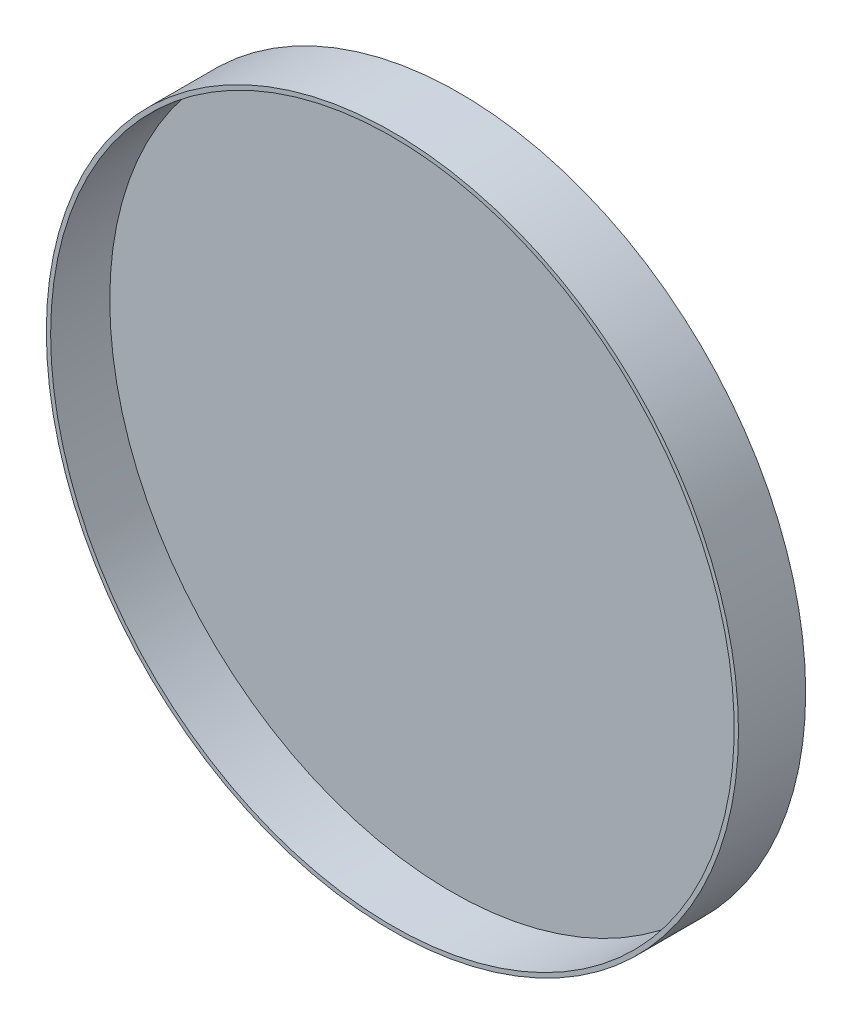
ISO-10303-21;
HEADER;
FILE_DESCRIPTION(('STEP AP214'),'2;1');
FILE_NAME('part.step','',(''),(''),'','','');
FILE_SCHEMA(('AUTOMOTIVE_DESIGN { 1 0 10303 214 1 1 1 1 }'));
ENDSEC;
DATA;
#1=APPLICATION_CONTEXT('core data for automotive mechanical design processes');
#2=APPLICATION_PROTOCOL_DEFINITION('international standard','automotive_design',2000,#1);
#3=PRODUCT_CONTEXT('',#1,'mechanical');
#4=PRODUCT('Part','Part','',(#3));
#5=PRODUCT_RELATED_PRODUCT_CATEGORY('part','',(#4));
#6=PRODUCT_DEFINITION_FORMATION('','',#4);
#7=PRODUCT_DEFINITION_CONTEXT('part definition',#1,'design');
#8=PRODUCT_DEFINITION('design','',#6,#7);
#9=PRODUCT_DEFINITION_SHAPE('','',#8);
#10=(LENGTH_UNIT() NAMED_UNIT(*) SI_UNIT(.MILLI.,.METRE.));
#11=(NAMED_UNIT(*) PLANE_ANGLE_UNIT() SI_UNIT($,.RADIAN.));
#12=(NAMED_UNIT(*) SI_UNIT($,.STERADIAN.) SOLID_ANGLE_UNIT());
#13=UNCERTAINTY_MEASURE_WITH_UNIT(LENGTH_MEASURE(1.E-05),#10,'distance_accuracy_value','');
#14=(GEOMETRIC_REPRESENTATION_CONTEXT(3) GLOBAL_UNCERTAINTY_ASSIGNED_CONTEXT((#13)) GLOBAL_UNIT_ASSIGNED_CONTEXT((#10,
#11,#12)) REPRESENTATION_CONTEXT('',''));
#15=CARTESIAN_POINT('',(0.,0.,0.));
#16=DIRECTION('',(0.,0.,1.));
#17=DIRECTION('',(1.,0.,0.));
#18=AXIS2_PLACEMENT_3D('',#15,#16,#17);
#19=CARTESIAN_POINT('',(0.,0.,0.));
#20=DIRECTION('',(0.,0.,-1.));
#21=DIRECTION('',(-1.,0.,0.));
#22=AXIS2_PLACEMENT_3D('',#19,#20,#21);
#23=PLANE('',#22);
#24=CARTESIAN_POINT('',(0.,0.,0.));
#25=DIRECTION('',(0.,0.,-1.));
#26=DIRECTION('',(-1.,0.,0.));
#27=AXIS2_PLACEMENT_3D('',#24,#25,#26);
#28=CIRCLE('',#27,32.2961);
#29=CARTESIAN_POINT('',(-32.2961,0.,0.));
#30=VERTEX_POINT('',#29);
#31=EDGE_CURVE('E16',#30,#30,#28,.F.);
#32=ORIENTED_EDGE('',*,*,#31,.T.);
#33=EDGE_LOOP('',(#32));
#34=FACE_BOUND('',#33,.T.);
#35=ADVANCED_FACE('F13',(#34),#23,.F.);
#36=CARTESIAN_POINT('',(0.,0.,5.588));
#37=DIRECTION('',(0.,0.,-1.));
#38=DIRECTION('',(-1.,0.,0.));
#39=AXIS2_PLACEMENT_3D('',#36,#37,#38);
#40=CYLINDRICAL_SURFACE('',#39,32.2961);
#41=CARTESIAN_POINT('',(0.,0.,5.588));
#42=DIRECTION('',(0.,0.,-1.));
#43=DIRECTION('',(-1.,0.,0.));
#44=AXIS2_PLACEMENT_3D('',#41,#42,#43);
#45=CIRCLE('',#44,32.2961);
#46=CARTESIAN_POINT('',(-32.2961,0.,5.588));
#47=VERTEX_POINT('',#46);
#48=EDGE_CURVE('E25',#47,#47,#45,.T.);
#49=ORIENTED_EDGE('',*,*,#48,.F.);
#50=EDGE_LOOP('',(#49));
#51=FACE_BOUND('',#50,.T.);
#52=ORIENTED_EDGE('',*,*,#31,.F.);
#53=EDGE_LOOP('',(#52));
#54=FACE_BOUND('',#53,.T.);
#55=ADVANCED_FACE('F34',(#51,#54),#40,.F.);
#56=CARTESIAN_POINT('',(0.,0.,5.588));
#57=DIRECTION('',(0.,0.,1.));
#58=DIRECTION('',(1.,0.,0.));
#59=AXIS2_PLACEMENT_3D('',#56,#57,#58);
#60=PLANE('',#59);
#61=ORIENTED_EDGE('',*,*,#48,.T.);
#62=EDGE_LOOP('',(#61));
#63=FACE_BOUND('',#62,.T.);
#64=CARTESIAN_POINT('',(0.,0.,5.588));
#65=DIRECTION('',(0.,0.,-1.));
#66=DIRECTION('',(-1.,0.,0.));
#67=AXIS2_PLACEMENT_3D('',#64,#65,#66);
#68=CIRCLE('',#67,32.7025);
#69=CARTESIAN_POINT('',(-32.7025,0.,5.588));
#70=VERTEX_POINT('',#69);
#71=EDGE_CURVE('E20',#70,#70,#68,.T.);
#72=ORIENTED_EDGE('',*,*,#71,.F.);
#73=EDGE_LOOP('',(#72));
#74=FACE_BOUND('',#73,.T.);
#75=ADVANCED_FACE('F36',(#63,#74),#60,.T.);
#76=CARTESIAN_POINT('',(0.,0.,5.588));
#77=DIRECTION('',(0.,0.,-1.));
#78=DIRECTION('',(-1.,0.,0.));
#79=AXIS2_PLACEMENT_3D('',#76,#77,#78);
#80=CYLINDRICAL_SURFACE('',#79,32.7025);
#81=ORIENTED_EDGE('',*,*,#71,.T.);
#82=EDGE_LOOP('',(#81));
#83=FACE_BOUND('',#82,.T.);
#84=CARTESIAN_POINT('',(0.,0.,-0.762));
#85=DIRECTION('',(0.,0.,-1.));
#86=DIRECTION('',(-1.,0.,0.));
#87=AXIS2_PLACEMENT_3D('',#84,#85,#86);
#88=CIRCLE('',#87,32.7025);
#89=CARTESIAN_POINT('',(-32.7025,0.,-0.762));
#90=VERTEX_POINT('',#89);
#91=EDGE_CURVE('E9',#90,#90,#88,.T.);
#92=ORIENTED_EDGE('',*,*,#91,.F.);
#93=EDGE_LOOP('',(#92));
#94=FACE_BOUND('',#93,.T.);
#95=ADVANCED_FACE('F43',(#83,#94),#80,.T.);
#96=CARTESIAN_POINT('',(0.,0.,-0.762));
#97=DIRECTION('',(0.,0.,-1.));
#98=DIRECTION('',(-1.,0.,0.));
#99=AXIS2_PLACEMENT_3D('',#96,#97,#98);
#100=PLANE('',#99);
#101=ORIENTED_EDGE('',*,*,#91,.T.);
#102=EDGE_LOOP('',(#101));
#103=FACE_BOUND('',#102,.T.);
#104=ADVANCED_FACE('F46',(#103),#100,.T.);
#105=CLOSED_SHELL('',(#35,#55,#75,#95,#104));
#106=MANIFOLD_SOLID_BREP('B1',#105);
#107=ADVANCED_BREP_SHAPE_REPRESENTATION('',(#18,#106),#14);
#108=SHAPE_DEFINITION_REPRESENTATION(#9,#107);
ENDSEC;
END-ISO-10303-21;
